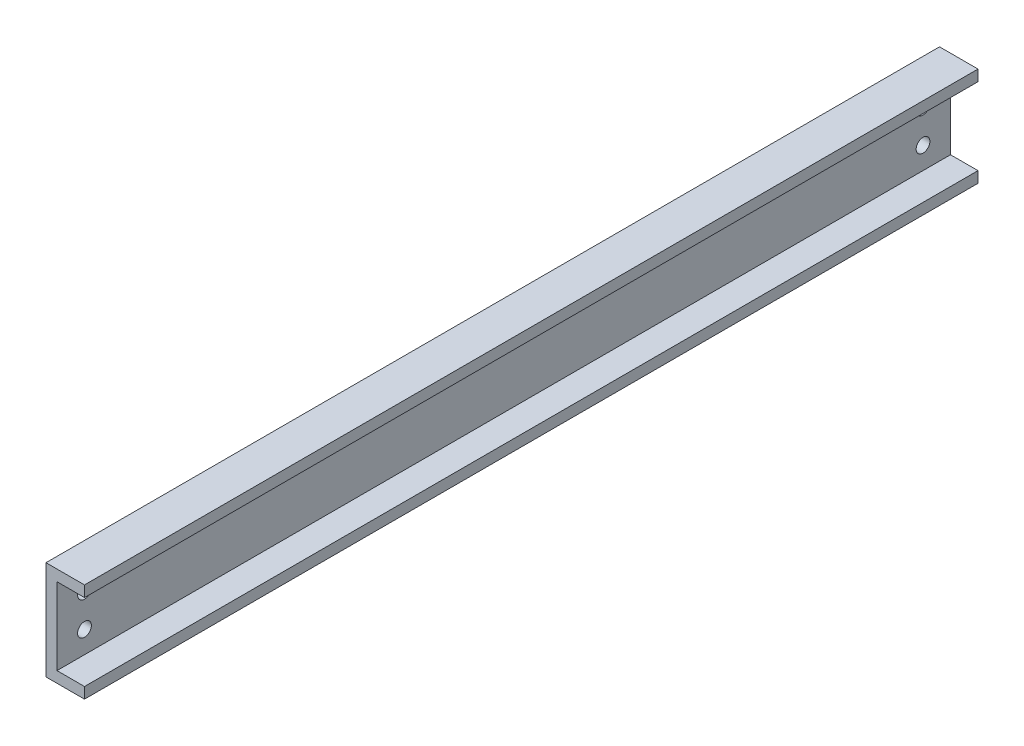
ISO-10303-21;
HEADER;
FILE_DESCRIPTION(('STEP AP214'),'2;1');
FILE_NAME('part.step','',(''),(''),'','','');
FILE_SCHEMA(('AUTOMOTIVE_DESIGN { 1 0 10303 214 1 1 1 1 }'));
ENDSEC;
DATA;
#1=APPLICATION_CONTEXT('core data for automotive mechanical design processes');
#2=APPLICATION_PROTOCOL_DEFINITION('international standard','automotive_design',2000,#1);
#3=PRODUCT_CONTEXT('',#1,'mechanical');
#4=PRODUCT('Part','Part','',(#3));
#5=PRODUCT_RELATED_PRODUCT_CATEGORY('part','',(#4));
#6=PRODUCT_DEFINITION_FORMATION('','',#4);
#7=PRODUCT_DEFINITION_CONTEXT('part definition',#1,'design');
#8=PRODUCT_DEFINITION('design','',#6,#7);
#9=PRODUCT_DEFINITION_SHAPE('','',#8);
#10=(LENGTH_UNIT() NAMED_UNIT(*) SI_UNIT(.MILLI.,.METRE.));
#11=(NAMED_UNIT(*) PLANE_ANGLE_UNIT() SI_UNIT($,.RADIAN.));
#12=(NAMED_UNIT(*) SI_UNIT($,.STERADIAN.) SOLID_ANGLE_UNIT());
#13=UNCERTAINTY_MEASURE_WITH_UNIT(LENGTH_MEASURE(1.E-05),#10,'distance_accuracy_value','');
#14=(GEOMETRIC_REPRESENTATION_CONTEXT(3) GLOBAL_UNCERTAINTY_ASSIGNED_CONTEXT((#13)) GLOBAL_UNIT_ASSIGNED_CONTEXT((#10,
#11,#12)) REPRESENTATION_CONTEXT('',''));
#15=CARTESIAN_POINT('',(0.,0.,0.));
#16=DIRECTION('',(0.,0.,1.));
#17=DIRECTION('',(1.,0.,0.));
#18=AXIS2_PLACEMENT_3D('',#15,#16,#17);
#19=CARTESIAN_POINT('',(0.,9.,-162.5));
#20=DIRECTION('',(0.,1.,0.));
#21=DIRECTION('',(0.,0.,1.));
#22=AXIS2_PLACEMENT_3D('',#19,#20,#21);
#23=PLANE('',#22);
#24=DIRECTION('',(-1.,0.,0.));
#25=VECTOR('',#24,1.);
#26=CARTESIAN_POINT('',(0.,9.,0.));
#27=LINE('',#26,#25);
#28=CARTESIAN_POINT('',(7.,9.,0.));
#29=VERTEX_POINT('',#28);
#30=CARTESIAN_POINT('',(0.,9.,0.));
#31=VERTEX_POINT('',#30);
#32=EDGE_CURVE('E134',#29,#31,#27,.T.);
#33=ORIENTED_EDGE('',*,*,#32,.F.);
#34=DIRECTION('',(0.,0.,1.));
#35=VECTOR('',#34,1.);
#36=CARTESIAN_POINT('',(7.,9.,-162.5));
#37=LINE('',#36,#35);
#38=CARTESIAN_POINT('',(7.,9.,-162.5));
#39=VERTEX_POINT('',#38);
#40=EDGE_CURVE('E11',#39,#29,#37,.T.);
#41=ORIENTED_EDGE('',*,*,#40,.F.);
#42=DIRECTION('',(-1.,0.,0.));
#43=VECTOR('',#42,1.);
#44=CARTESIAN_POINT('',(0.,9.,-162.5));
#45=LINE('',#44,#43);
#46=CARTESIAN_POINT('',(0.,9.,-162.5));
#47=VERTEX_POINT('',#46);
#48=EDGE_CURVE('E155',#39,#47,#45,.T.);
#49=ORIENTED_EDGE('',*,*,#48,.T.);
#50=DIRECTION('',(0.,0.,1.));
#51=VECTOR('',#50,1.);
#52=CARTESIAN_POINT('',(0.,9.,-162.5));
#53=LINE('',#52,#51);
#54=EDGE_CURVE('E40',#47,#31,#53,.T.);
#55=ORIENTED_EDGE('',*,*,#54,.T.);
#56=EDGE_LOOP('',(#33,#41,#49,#55));
#57=FACE_BOUND('',#56,.T.);
#58=ADVANCED_FACE('F37',(#57),#23,.T.);
#59=CARTESIAN_POINT('',(7.,9.,-162.5));
#60=DIRECTION('',(1.,0.,0.));
#61=DIRECTION('',(0.,0.,-1.));
#62=AXIS2_PLACEMENT_3D('',#59,#60,#61);
#63=PLANE('',#62);
#64=DIRECTION('',(0.,1.,0.));
#65=VECTOR('',#64,1.);
#66=CARTESIAN_POINT('',(7.,9.,0.));
#67=LINE('',#66,#65);
#68=CARTESIAN_POINT('',(7.,7.,0.));
#69=VERTEX_POINT('',#68);
#70=EDGE_CURVE('E153',#69,#29,#67,.T.);
#71=ORIENTED_EDGE('',*,*,#70,.F.);
#72=DIRECTION('',(0.,0.,1.));
#73=VECTOR('',#72,1.);
#74=CARTESIAN_POINT('',(7.,7.,-162.5));
#75=LINE('',#74,#73);
#76=CARTESIAN_POINT('',(7.,7.,-162.5));
#77=VERTEX_POINT('',#76);
#78=EDGE_CURVE('E46',#77,#69,#75,.T.);
#79=ORIENTED_EDGE('',*,*,#78,.F.);
#80=DIRECTION('',(0.,1.,0.));
#81=VECTOR('',#80,1.);
#82=CARTESIAN_POINT('',(7.,9.,-162.5));
#83=LINE('',#82,#81);
#84=EDGE_CURVE('E124',#77,#39,#83,.T.);
#85=ORIENTED_EDGE('',*,*,#84,.T.);
#86=ORIENTED_EDGE('',*,*,#40,.T.);
#87=EDGE_LOOP('',(#71,#79,#85,#86));
#88=FACE_BOUND('',#87,.T.);
#89=ADVANCED_FACE('F167',(#88),#63,.T.);
#90=CARTESIAN_POINT('',(2.,7.,-162.5));
#91=DIRECTION('',(0.,-1.,0.));
#92=DIRECTION('',(0.,0.,-1.));
#93=AXIS2_PLACEMENT_3D('',#90,#91,#92);
#94=PLANE('',#93);
#95=DIRECTION('',(1.,0.,0.));
#96=VECTOR('',#95,1.);
#97=CARTESIAN_POINT('',(2.,7.,0.));
#98=LINE('',#97,#96);
#99=CARTESIAN_POINT('',(2.,7.,0.));
#100=VERTEX_POINT('',#99);
#101=EDGE_CURVE('E111',#100,#69,#98,.T.);
#102=ORIENTED_EDGE('',*,*,#101,.F.);
#103=DIRECTION('',(0.,0.,1.));
#104=VECTOR('',#103,1.);
#105=CARTESIAN_POINT('',(2.,7.,-162.5));
#106=LINE('',#105,#104);
#107=CARTESIAN_POINT('',(2.,7.,-162.5));
#108=VERTEX_POINT('',#107);
#109=EDGE_CURVE('E106',#108,#100,#106,.T.);
#110=ORIENTED_EDGE('',*,*,#109,.F.);
#111=DIRECTION('',(1.,0.,0.));
#112=VECTOR('',#111,1.);
#113=CARTESIAN_POINT('',(2.,7.,-162.5));
#114=LINE('',#113,#112);
#115=EDGE_CURVE('E109',#108,#77,#114,.T.);
#116=ORIENTED_EDGE('',*,*,#115,.T.);
#117=ORIENTED_EDGE('',*,*,#78,.T.);
#118=EDGE_LOOP('',(#102,#110,#116,#117));
#119=FACE_BOUND('',#118,.T.);
#120=ADVANCED_FACE('F108',(#119),#94,.T.);
#121=CARTESIAN_POINT('',(2.,7.,-162.5));
#122=DIRECTION('',(1.,0.,0.));
#123=DIRECTION('',(0.,0.,-1.));
#124=AXIS2_PLACEMENT_3D('',#121,#122,#123);
#125=PLANE('',#124);
#126=CARTESIAN_POINT('',(2.,2.99999999999998,-157.5));
#127=DIRECTION('',(1.,0.,0.));
#128=DIRECTION('',(0.,0.,-1.));
#129=AXIS2_PLACEMENT_3D('',#126,#127,#128);
#130=CIRCLE('',#129,1.25000000000001);
#131=CARTESIAN_POINT('',(2.,2.99999999999998,-158.75));
#132=VERTEX_POINT('',#131);
#133=EDGE_CURVE('E138',#132,#132,#130,.T.);
#134=ORIENTED_EDGE('',*,*,#133,.F.);
#135=EDGE_LOOP('',(#134));
#136=FACE_BOUND('',#135,.T.);
#137=CARTESIAN_POINT('',(2.,-3.00000000000002,-157.5));
#138=DIRECTION('',(1.,0.,0.));
#139=DIRECTION('',(0.,0.,-1.));
#140=AXIS2_PLACEMENT_3D('',#137,#138,#139);
#141=CIRCLE('',#140,1.25000000000001);
#142=CARTESIAN_POINT('',(2.,-3.00000000000002,-158.75));
#143=VERTEX_POINT('',#142);
#144=EDGE_CURVE('E224',#143,#143,#141,.T.);
#145=ORIENTED_EDGE('',*,*,#144,.F.);
#146=EDGE_LOOP('',(#145));
#147=FACE_BOUND('',#146,.T.);
#148=CARTESIAN_POINT('',(2.,-3.,-5.));
#149=DIRECTION('',(1.,0.,0.));
#150=DIRECTION('',(0.,0.,-1.));
#151=AXIS2_PLACEMENT_3D('',#148,#149,#150);
#152=CIRCLE('',#151,1.25);
#153=CARTESIAN_POINT('',(2.,-3.,-6.25));
#154=VERTEX_POINT('',#153);
#155=EDGE_CURVE('E216',#154,#154,#152,.T.);
#156=ORIENTED_EDGE('',*,*,#155,.F.);
#157=EDGE_LOOP('',(#156));
#158=FACE_BOUND('',#157,.T.);
#159=CARTESIAN_POINT('',(2.,3.,-5.));
#160=DIRECTION('',(1.,0.,0.));
#161=DIRECTION('',(0.,0.,-1.));
#162=AXIS2_PLACEMENT_3D('',#159,#160,#161);
#163=CIRCLE('',#162,1.25);
#164=CARTESIAN_POINT('',(2.,3.,-6.25));
#165=VERTEX_POINT('',#164);
#166=EDGE_CURVE('E213',#165,#165,#163,.T.);
#167=ORIENTED_EDGE('',*,*,#166,.F.);
#168=EDGE_LOOP('',(#167));
#169=FACE_BOUND('',#168,.T.);
#170=DIRECTION('',(0.,1.,0.));
#171=VECTOR('',#170,1.);
#172=CARTESIAN_POINT('',(2.,7.,0.));
#173=LINE('',#172,#171);
#174=CARTESIAN_POINT('',(2.,-7.,0.));
#175=VERTEX_POINT('',#174);
#176=EDGE_CURVE('E150',#175,#100,#173,.T.);
#177=ORIENTED_EDGE('',*,*,#176,.F.);
#178=DIRECTION('',(0.,0.,1.));
#179=VECTOR('',#178,1.);
#180=CARTESIAN_POINT('',(2.,-7.,-162.5));
#181=LINE('',#180,#179);
#182=CARTESIAN_POINT('',(2.,-7.,-162.5));
#183=VERTEX_POINT('',#182);
#184=EDGE_CURVE('E116',#183,#175,#181,.T.);
#185=ORIENTED_EDGE('',*,*,#184,.F.);
#186=DIRECTION('',(0.,1.,0.));
#187=VECTOR('',#186,1.);
#188=CARTESIAN_POINT('',(2.,7.,-162.5));
#189=LINE('',#188,#187);
#190=EDGE_CURVE('E122',#183,#108,#189,.T.);
#191=ORIENTED_EDGE('',*,*,#190,.T.);
#192=ORIENTED_EDGE('',*,*,#109,.T.);
#193=EDGE_LOOP('',(#177,#185,#191,#192));
#194=FACE_BOUND('',#193,.T.);
#195=ADVANCED_FACE('F126',(#136,#147,#158,#169,#194),#125,.T.);
#196=CARTESIAN_POINT('',(2.,-7.,-162.5));
#197=DIRECTION('',(0.,1.,0.));
#198=DIRECTION('',(-1.,0.,0.));
#199=AXIS2_PLACEMENT_3D('',#196,#197,#198);
#200=PLANE('',#199);
#201=DIRECTION('',(-1.,0.,0.));
#202=VECTOR('',#201,1.);
#203=CARTESIAN_POINT('',(2.,-7.,0.));
#204=LINE('',#203,#202);
#205=CARTESIAN_POINT('',(7.,-7.,0.));
#206=VERTEX_POINT('',#205);
#207=EDGE_CURVE('E147',#206,#175,#204,.T.);
#208=ORIENTED_EDGE('',*,*,#207,.F.);
#209=DIRECTION('',(0.,0.,1.));
#210=VECTOR('',#209,1.);
#211=CARTESIAN_POINT('',(7.,-7.,-162.5));
#212=LINE('',#211,#210);
#213=CARTESIAN_POINT('',(7.,-7.,-162.5));
#214=VERTEX_POINT('',#213);
#215=EDGE_CURVE('E159',#214,#206,#212,.T.);
#216=ORIENTED_EDGE('',*,*,#215,.F.);
#217=DIRECTION('',(-1.,0.,0.));
#218=VECTOR('',#217,1.);
#219=CARTESIAN_POINT('',(2.,-7.,-162.5));
#220=LINE('',#219,#218);
#221=EDGE_CURVE('E127',#214,#183,#220,.T.);
#222=ORIENTED_EDGE('',*,*,#221,.T.);
#223=ORIENTED_EDGE('',*,*,#184,.T.);
#224=EDGE_LOOP('',(#208,#216,#222,#223));
#225=FACE_BOUND('',#224,.T.);
#226=ADVANCED_FACE('F180',(#225),#200,.T.);
#227=CARTESIAN_POINT('',(7.,-9.,-162.5));
#228=DIRECTION('',(1.,0.,0.));
#229=DIRECTION('',(0.,0.,-1.));
#230=AXIS2_PLACEMENT_3D('',#227,#228,#229);
#231=PLANE('',#230);
#232=DIRECTION('',(0.,1.,0.));
#233=VECTOR('',#232,1.);
#234=CARTESIAN_POINT('',(7.,-9.,0.));
#235=LINE('',#234,#233);
#236=CARTESIAN_POINT('',(7.,-9.,0.));
#237=VERTEX_POINT('',#236);
#238=EDGE_CURVE('E144',#237,#206,#235,.T.);
#239=ORIENTED_EDGE('',*,*,#238,.F.);
#240=DIRECTION('',(0.,0.,1.));
#241=VECTOR('',#240,1.);
#242=CARTESIAN_POINT('',(7.,-9.,-162.5));
#243=LINE('',#242,#241);
#244=CARTESIAN_POINT('',(7.,-9.,-162.5));
#245=VERTEX_POINT('',#244);
#246=EDGE_CURVE('E161',#245,#237,#243,.T.);
#247=ORIENTED_EDGE('',*,*,#246,.F.);
#248=DIRECTION('',(0.,1.,0.));
#249=VECTOR('',#248,1.);
#250=CARTESIAN_POINT('',(7.,-9.,-162.5));
#251=LINE('',#250,#249);
#252=EDGE_CURVE('E129',#245,#214,#251,.T.);
#253=ORIENTED_EDGE('',*,*,#252,.T.);
#254=ORIENTED_EDGE('',*,*,#215,.T.);
#255=EDGE_LOOP('',(#239,#247,#253,#254));
#256=FACE_BOUND('',#255,.T.);
#257=ADVANCED_FACE('F184',(#256),#231,.T.);
#258=CARTESIAN_POINT('',(0.,-9.,-162.5));
#259=DIRECTION('',(0.,-1.,0.));
#260=DIRECTION('',(0.,0.,-1.));
#261=AXIS2_PLACEMENT_3D('',#258,#259,#260);
#262=PLANE('',#261);
#263=DIRECTION('',(1.,0.,0.));
#264=VECTOR('',#263,1.);
#265=CARTESIAN_POINT('',(0.,-9.,0.));
#266=LINE('',#265,#264);
#267=CARTESIAN_POINT('',(0.,-9.,0.));
#268=VERTEX_POINT('',#267);
#269=EDGE_CURVE('E141',#268,#237,#266,.T.);
#270=ORIENTED_EDGE('',*,*,#269,.F.);
#271=DIRECTION('',(0.,0.,1.));
#272=VECTOR('',#271,1.);
#273=CARTESIAN_POINT('',(0.,-9.,-162.5));
#274=LINE('',#273,#272);
#275=CARTESIAN_POINT('',(0.,-9.,-162.5));
#276=VERTEX_POINT('',#275);
#277=EDGE_CURVE('E162',#276,#268,#274,.T.);
#278=ORIENTED_EDGE('',*,*,#277,.F.);
#279=DIRECTION('',(1.,0.,0.));
#280=VECTOR('',#279,1.);
#281=CARTESIAN_POINT('',(0.,-9.,-162.5));
#282=LINE('',#281,#280);
#283=EDGE_CURVE('E232',#276,#245,#282,.T.);
#284=ORIENTED_EDGE('',*,*,#283,.T.);
#285=ORIENTED_EDGE('',*,*,#246,.T.);
#286=EDGE_LOOP('',(#270,#278,#284,#285));
#287=FACE_BOUND('',#286,.T.);
#288=ADVANCED_FACE('F188',(#287),#262,.T.);
#289=CARTESIAN_POINT('',(0.,9.,-162.5));
#290=DIRECTION('',(-1.,0.,0.));
#291=DIRECTION('',(0.,-1.,0.));
#292=AXIS2_PLACEMENT_3D('',#289,#290,#291);
#293=PLANE('',#292);
#294=CARTESIAN_POINT('',(0.,2.99999999999998,-157.5));
#295=DIRECTION('',(-1.,0.,0.));
#296=DIRECTION('',(0.,1.,0.));
#297=AXIS2_PLACEMENT_3D('',#294,#295,#296);
#298=CIRCLE('',#297,1.25000000000001);
#299=CARTESIAN_POINT('',(0.,4.24999999999999,-157.5));
#300=VERTEX_POINT('',#299);
#301=EDGE_CURVE('E200',#300,#300,#298,.T.);
#302=ORIENTED_EDGE('',*,*,#301,.F.);
#303=EDGE_LOOP('',(#302));
#304=FACE_BOUND('',#303,.T.);
#305=CARTESIAN_POINT('',(0.,-3.00000000000002,-157.5));
#306=DIRECTION('',(-1.,0.,0.));
#307=DIRECTION('',(0.,-1.,0.));
#308=AXIS2_PLACEMENT_3D('',#305,#306,#307);
#309=CIRCLE('',#308,1.25000000000001);
#310=CARTESIAN_POINT('',(0.,-4.25000000000003,-157.5));
#311=VERTEX_POINT('',#310);
#312=EDGE_CURVE('E204',#311,#311,#309,.T.);
#313=ORIENTED_EDGE('',*,*,#312,.F.);
#314=EDGE_LOOP('',(#313));
#315=FACE_BOUND('',#314,.T.);
#316=CARTESIAN_POINT('',(0.,-3.,-5.));
#317=DIRECTION('',(-1.,0.,0.));
#318=DIRECTION('',(0.,1.,0.));
#319=AXIS2_PLACEMENT_3D('',#316,#317,#318);
#320=CIRCLE('',#319,1.25);
#321=CARTESIAN_POINT('',(0.,-1.75,-5.));
#322=VERTEX_POINT('',#321);
#323=EDGE_CURVE('E208',#322,#322,#320,.T.);
#324=ORIENTED_EDGE('',*,*,#323,.F.);
#325=EDGE_LOOP('',(#324));
#326=FACE_BOUND('',#325,.T.);
#327=CARTESIAN_POINT('',(0.,3.,-5.));
#328=DIRECTION('',(-1.,0.,0.));
#329=DIRECTION('',(0.,-1.,0.));
#330=AXIS2_PLACEMENT_3D('',#327,#328,#329);
#331=CIRCLE('',#330,1.25);
#332=CARTESIAN_POINT('',(0.,1.75,-5.));
#333=VERTEX_POINT('',#332);
#334=EDGE_CURVE('E211',#333,#333,#331,.T.);
#335=ORIENTED_EDGE('',*,*,#334,.F.);
#336=EDGE_LOOP('',(#335));
#337=FACE_BOUND('',#336,.T.);
#338=DIRECTION('',(0.,-1.,0.));
#339=VECTOR('',#338,1.);
#340=CARTESIAN_POINT('',(0.,9.,0.));
#341=LINE('',#340,#339);
#342=EDGE_CURVE('E137',#31,#268,#341,.T.);
#343=ORIENTED_EDGE('',*,*,#342,.F.);
#344=ORIENTED_EDGE('',*,*,#54,.F.);
#345=DIRECTION('',(0.,-1.,0.));
#346=VECTOR('',#345,1.);
#347=CARTESIAN_POINT('',(0.,9.,-162.5));
#348=LINE('',#347,#346);
#349=EDGE_CURVE('E230',#47,#276,#348,.T.);
#350=ORIENTED_EDGE('',*,*,#349,.T.);
#351=ORIENTED_EDGE('',*,*,#277,.T.);
#352=EDGE_LOOP('',(#343,#344,#350,#351));
#353=FACE_BOUND('',#352,.T.);
#354=ADVANCED_FACE('F164',(#304,#315,#326,#337,#353),#293,.T.);
#355=CARTESIAN_POINT('',(0.,0.,-162.5));
#356=DIRECTION('',(0.,0.,-1.));
#357=DIRECTION('',(-1.,0.,0.));
#358=AXIS2_PLACEMENT_3D('',#355,#356,#357);
#359=PLANE('',#358);
#360=ORIENTED_EDGE('',*,*,#48,.F.);
#361=ORIENTED_EDGE('',*,*,#84,.F.);
#362=ORIENTED_EDGE('',*,*,#115,.F.);
#363=ORIENTED_EDGE('',*,*,#190,.F.);
#364=ORIENTED_EDGE('',*,*,#221,.F.);
#365=ORIENTED_EDGE('',*,*,#252,.F.);
#366=ORIENTED_EDGE('',*,*,#283,.F.);
#367=ORIENTED_EDGE('',*,*,#349,.F.);
#368=EDGE_LOOP('',(#360,#361,#362,#363,#364,#365,#366,#367));
#369=FACE_BOUND('',#368,.T.);
#370=ADVANCED_FACE('F120',(#369),#359,.T.);
#371=CARTESIAN_POINT('',(0.,0.,0.));
#372=DIRECTION('',(0.,0.,-1.));
#373=DIRECTION('',(-1.,0.,0.));
#374=AXIS2_PLACEMENT_3D('',#371,#372,#373);
#375=PLANE('',#374);
#376=ORIENTED_EDGE('',*,*,#32,.T.);
#377=ORIENTED_EDGE('',*,*,#342,.T.);
#378=ORIENTED_EDGE('',*,*,#269,.T.);
#379=ORIENTED_EDGE('',*,*,#238,.T.);
#380=ORIENTED_EDGE('',*,*,#207,.T.);
#381=ORIENTED_EDGE('',*,*,#176,.T.);
#382=ORIENTED_EDGE('',*,*,#101,.T.);
#383=ORIENTED_EDGE('',*,*,#70,.T.);
#384=EDGE_LOOP('',(#376,#377,#378,#379,#380,#381,#382,#383));
#385=FACE_BOUND('',#384,.T.);
#386=ADVANCED_FACE('F166',(#385),#375,.F.);
#387=CARTESIAN_POINT('',(7.,3.,-5.));
#388=DIRECTION('',(-1.,0.,0.));
#389=DIRECTION('',(0.,-1.,0.));
#390=AXIS2_PLACEMENT_3D('',#387,#388,#389);
#391=CYLINDRICAL_SURFACE('',#390,1.25);
#392=ORIENTED_EDGE('',*,*,#166,.T.);
#393=EDGE_LOOP('',(#392));
#394=FACE_BOUND('',#393,.T.);
#395=ORIENTED_EDGE('',*,*,#334,.T.);
#396=EDGE_LOOP('',(#395));
#397=FACE_BOUND('',#396,.T.);
#398=ADVANCED_FACE('F250',(#394,#397),#391,.F.);
#399=CARTESIAN_POINT('',(7.,-3.,-5.));
#400=DIRECTION('',(-1.,0.,0.));
#401=DIRECTION('',(0.,-1.,0.));
#402=AXIS2_PLACEMENT_3D('',#399,#400,#401);
#403=CYLINDRICAL_SURFACE('',#402,1.25);
#404=ORIENTED_EDGE('',*,*,#155,.T.);
#405=EDGE_LOOP('',(#404));
#406=FACE_BOUND('',#405,.T.);
#407=ORIENTED_EDGE('',*,*,#323,.T.);
#408=EDGE_LOOP('',(#407));
#409=FACE_BOUND('',#408,.T.);
#410=ADVANCED_FACE('F252',(#406,#409),#403,.F.);
#411=CARTESIAN_POINT('',(7.,-3.00000000000002,-157.5));
#412=DIRECTION('',(-1.,0.,0.));
#413=DIRECTION('',(0.,-1.,0.));
#414=AXIS2_PLACEMENT_3D('',#411,#412,#413);
#415=CYLINDRICAL_SURFACE('',#414,1.25000000000001);
#416=ORIENTED_EDGE('',*,*,#144,.T.);
#417=EDGE_LOOP('',(#416));
#418=FACE_BOUND('',#417,.T.);
#419=ORIENTED_EDGE('',*,*,#312,.T.);
#420=EDGE_LOOP('',(#419));
#421=FACE_BOUND('',#420,.T.);
#422=ADVANCED_FACE('F258',(#418,#421),#415,.F.);
#423=CARTESIAN_POINT('',(7.,2.99999999999998,-157.5));
#424=DIRECTION('',(-1.,0.,0.));
#425=DIRECTION('',(0.,-1.,0.));
#426=AXIS2_PLACEMENT_3D('',#423,#424,#425);
#427=CYLINDRICAL_SURFACE('',#426,1.25000000000001);
#428=ORIENTED_EDGE('',*,*,#133,.T.);
#429=EDGE_LOOP('',(#428));
#430=FACE_BOUND('',#429,.T.);
#431=ORIENTED_EDGE('',*,*,#301,.T.);
#432=EDGE_LOOP('',(#431));
#433=FACE_BOUND('',#432,.T.);
#434=ADVANCED_FACE('F241',(#430,#433),#427,.F.);
#435=CLOSED_SHELL('',(#58,#89,#120,#195,#226,#257,#288,#354,#370,#386,#398,#410,#422,#434));
#436=MANIFOLD_SOLID_BREP('B2',#435);
#437=ADVANCED_BREP_SHAPE_REPRESENTATION('',(#18,#436),#14);
#438=SHAPE_DEFINITION_REPRESENTATION(#9,#437);
ENDSEC;
END-ISO-10303-21;
